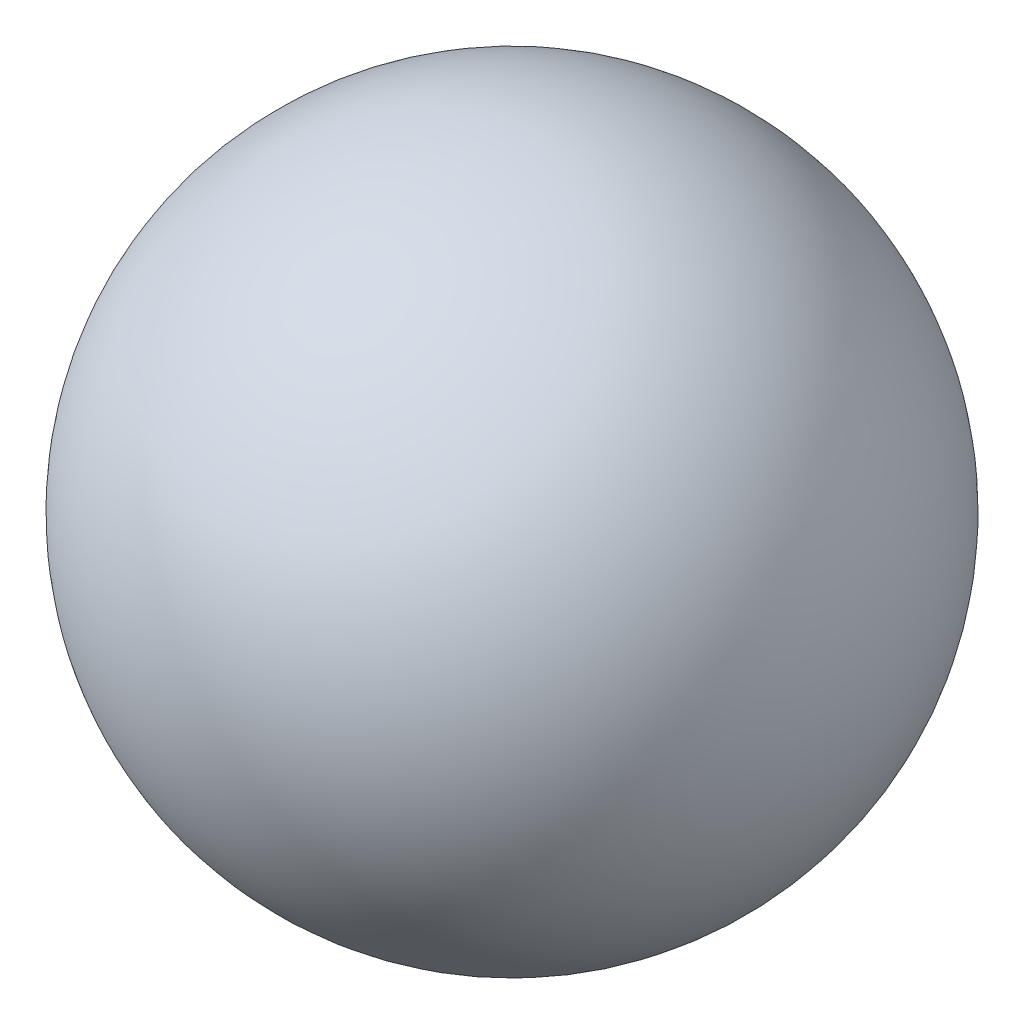
ISO-10303-21;
HEADER;
FILE_DESCRIPTION(('STEP AP214'),'2;1');
FILE_NAME('part.step','',(''),(''),'','','');
FILE_SCHEMA(('AUTOMOTIVE_DESIGN { 1 0 10303 214 1 1 1 1 }'));
ENDSEC;
DATA;
#1=APPLICATION_CONTEXT('core data for automotive mechanical design processes');
#2=APPLICATION_PROTOCOL_DEFINITION('international standard','automotive_design',2000,#1);
#3=PRODUCT_CONTEXT('',#1,'mechanical');
#4=PRODUCT('Part','Part','',(#3));
#5=PRODUCT_RELATED_PRODUCT_CATEGORY('part','',(#4));
#6=PRODUCT_DEFINITION_FORMATION('','',#4);
#7=PRODUCT_DEFINITION_CONTEXT('part definition',#1,'design');
#8=PRODUCT_DEFINITION('design','',#6,#7);
#9=PRODUCT_DEFINITION_SHAPE('','',#8);
#10=(LENGTH_UNIT() NAMED_UNIT(*) SI_UNIT(.MILLI.,.METRE.));
#11=(NAMED_UNIT(*) PLANE_ANGLE_UNIT() SI_UNIT($,.RADIAN.));
#12=(NAMED_UNIT(*) SI_UNIT($,.STERADIAN.) SOLID_ANGLE_UNIT());
#13=UNCERTAINTY_MEASURE_WITH_UNIT(LENGTH_MEASURE(1.E-05),#10,'distance_accuracy_value','');
#14=(GEOMETRIC_REPRESENTATION_CONTEXT(3) GLOBAL_UNCERTAINTY_ASSIGNED_CONTEXT((#13)) GLOBAL_UNIT_ASSIGNED_CONTEXT((#10,
#11,#12)) REPRESENTATION_CONTEXT('',''));
#15=CARTESIAN_POINT('',(0.,0.,0.));
#16=DIRECTION('',(0.,0.,1.));
#17=DIRECTION('',(1.,0.,0.));
#18=AXIS2_PLACEMENT_3D('',#15,#16,#17);
#19=CARTESIAN_POINT('',(10.6881759454156,-2.,4.88112640277219));
#20=DIRECTION('',(0.,0.,1.));
#21=DIRECTION('',(1.,0.,0.));
#22=AXIS2_PLACEMENT_3D('',#19,#20,#21);
#23=SPHERICAL_SURFACE('',#22,1.05);
#24=CARTESIAN_POINT('',(10.6881759454156,-2.,5.93112640277219));
#25=VERTEX_POINT('',#24);
#26=VERTEX_LOOP('',#25);
#27=FACE_BOUND('',#26,.T.);
#28=ADVANCED_FACE('F12',(#27),#23,.T.);
#29=CLOSED_SHELL('',(#28));
#30=MANIFOLD_SOLID_BREP('B1',#29);
#31=ADVANCED_BREP_SHAPE_REPRESENTATION('',(#18,#30),#14);
#32=SHAPE_DEFINITION_REPRESENTATION(#9,#31);
ENDSEC;
END-ISO-10303-21;
